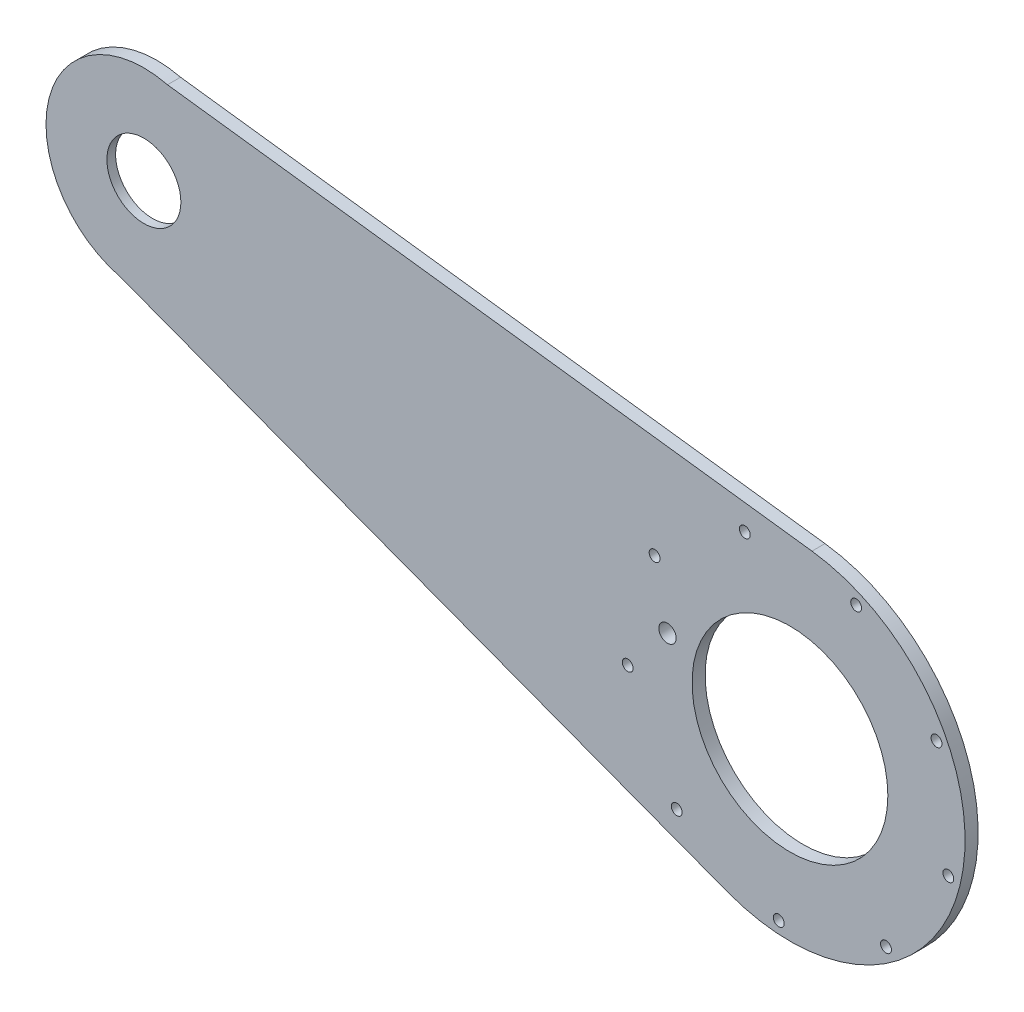
ISO-10303-21;
HEADER;
FILE_DESCRIPTION(('STEP AP214'),'2;1');
FILE_NAME('part.step','',(''),(''),'','','');
FILE_SCHEMA(('AUTOMOTIVE_DESIGN { 1 0 10303 214 1 1 1 1 }'));
ENDSEC;
DATA;
#1=APPLICATION_CONTEXT('core data for automotive mechanical design processes');
#2=APPLICATION_PROTOCOL_DEFINITION('international standard','automotive_design',2000,#1);
#3=PRODUCT_CONTEXT('',#1,'mechanical');
#4=PRODUCT('Part','Part','',(#3));
#5=PRODUCT_RELATED_PRODUCT_CATEGORY('part','',(#4));
#6=PRODUCT_DEFINITION_FORMATION('','',#4);
#7=PRODUCT_DEFINITION_CONTEXT('part definition',#1,'design');
#8=PRODUCT_DEFINITION('design','',#6,#7);
#9=PRODUCT_DEFINITION_SHAPE('','',#8);
#10=(LENGTH_UNIT() NAMED_UNIT(*) SI_UNIT(.MILLI.,.METRE.));
#11=(NAMED_UNIT(*) PLANE_ANGLE_UNIT() SI_UNIT($,.RADIAN.));
#12=(NAMED_UNIT(*) SI_UNIT($,.STERADIAN.) SOLID_ANGLE_UNIT());
#13=UNCERTAINTY_MEASURE_WITH_UNIT(LENGTH_MEASURE(1.E-05),#10,'distance_accuracy_value','');
#14=(GEOMETRIC_REPRESENTATION_CONTEXT(3) GLOBAL_UNCERTAINTY_ASSIGNED_CONTEXT((#13)) GLOBAL_UNIT_ASSIGNED_CONTEXT((#10,
#11,#12)) REPRESENTATION_CONTEXT('',''));
#15=CARTESIAN_POINT('',(0.,0.,0.));
#16=DIRECTION('',(0.,0.,1.));
#17=DIRECTION('',(1.,0.,0.));
#18=AXIS2_PLACEMENT_3D('',#15,#16,#17);
#19=CARTESIAN_POINT('',(-242.895087832448,97.1929347038201,3.));
#20=DIRECTION('',(0.,0.,-1.));
#21=DIRECTION('',(-1.,0.,0.));
#22=AXIS2_PLACEMENT_3D('',#19,#20,#21);
#23=CYLINDRICAL_SURFACE('',#22,11.5);
#24=CARTESIAN_POINT('',(-242.895087832448,97.1929347038201,0.));
#25=DIRECTION('',(0.,0.,1.));
#26=DIRECTION('',(1.,0.,0.));
#27=AXIS2_PLACEMENT_3D('',#24,#25,#26);
#28=CIRCLE('',#27,11.5);
#29=CARTESIAN_POINT('',(-231.395087832448,97.1929347038201,0.));
#30=VERTEX_POINT('',#29);
#31=EDGE_CURVE('E126',#30,#30,#28,.T.);
#32=ORIENTED_EDGE('',*,*,#31,.F.);
#33=EDGE_LOOP('',(#32));
#34=FACE_BOUND('',#33,.T.);
#35=CARTESIAN_POINT('',(-242.895087832448,97.1929347038201,1.));
#36=DIRECTION('',(0.,0.,1.));
#37=DIRECTION('',(1.,0.,0.));
#38=AXIS2_PLACEMENT_3D('',#35,#36,#37);
#39=CIRCLE('',#38,11.5);
#40=CARTESIAN_POINT('',(-231.395087832448,97.1929347038201,1.));
#41=VERTEX_POINT('',#40);
#42=EDGE_CURVE('E150',#41,#41,#39,.T.);
#43=ORIENTED_EDGE('',*,*,#42,.T.);
#44=EDGE_LOOP('',(#43));
#45=FACE_BOUND('',#44,.T.);
#46=ADVANCED_FACE('F42',(#34,#45),#23,.F.);
#47=CARTESIAN_POINT('',(-6.03186014017551,-15.997487339113,3.));
#48=DIRECTION('',(0.35280495243942,0.935696887637347,0.));
#49=DIRECTION('',(-0.935696887637348,0.35280495243942,0.));
#50=AXIS2_PLACEMENT_3D('',#47,#48,#49);
#51=PLANE('',#50);
#52=DIRECTION('',(0.935696887637348,-0.35280495243942,0.));
#53=VECTOR('',#52,1.);
#54=CARTESIAN_POINT('',(-6.03186014017551,-15.997487339113,0.));
#55=LINE('',#54,#53);
#56=CARTESIAN_POINT('',(-248.314941285306,75.3554625847872,0.));
#57=VERTEX_POINT('',#56);
#58=CARTESIAN_POINT('',(-108.60067589508,22.6761329777708,0.));
#59=VERTEX_POINT('',#58);
#60=EDGE_CURVE('E112',#57,#59,#55,.T.);
#61=ORIENTED_EDGE('',*,*,#60,.T.);
#62=DIRECTION('',(0.,0.,-1.));
#63=VECTOR('',#62,1.);
#64=CARTESIAN_POINT('',(-108.60067589508,22.6761329777708,3.));
#65=LINE('',#64,#63);
#66=CARTESIAN_POINT('',(-108.60067589508,22.6761329777708,3.));
#67=VERTEX_POINT('',#66);
#68=EDGE_CURVE('E11',#67,#59,#65,.T.);
#69=ORIENTED_EDGE('',*,*,#68,.F.);
#70=DIRECTION('',(0.935696887637348,-0.35280495243942,0.));
#71=VECTOR('',#70,1.);
#72=CARTESIAN_POINT('',(-6.03186014017551,-15.997487339113,3.));
#73=LINE('',#72,#71);
#74=CARTESIAN_POINT('',(-248.314941285306,75.3554625847872,3.));
#75=VERTEX_POINT('',#74);
#76=EDGE_CURVE('E91',#75,#67,#73,.T.);
#77=ORIENTED_EDGE('',*,*,#76,.F.);
#78=DIRECTION('',(0.,0.,-1.));
#79=VECTOR('',#78,1.);
#80=CARTESIAN_POINT('',(-248.314941285306,75.3554625847872,3.));
#81=LINE('',#80,#79);
#82=EDGE_CURVE('E111',#75,#57,#81,.T.);
#83=ORIENTED_EDGE('',*,*,#82,.T.);
#84=EDGE_LOOP('',(#61,#69,#77,#83));
#85=FACE_BOUND('',#84,.T.);
#86=ADVANCED_FACE('F44',(#85),#51,.F.);
#87=CARTESIAN_POINT('',(-94.400277143852,60.3379311550941,3.));
#88=DIRECTION('',(0.,0.,-1.));
#89=DIRECTION('',(-1.,0.,0.));
#90=AXIS2_PLACEMENT_3D('',#87,#88,#89);
#91=CYLINDRICAL_SURFACE('',#90,40.2499983433954);
#92=CARTESIAN_POINT('',(-94.400277143852,60.3379311550941,0.));
#93=DIRECTION('',(0.,0.,1.));
#94=DIRECTION('',(1.,0.,0.));
#95=AXIS2_PLACEMENT_3D('',#92,#93,#94);
#96=CIRCLE('',#95,40.2499983433954);
#97=CARTESIAN_POINT('',(-89.3428783464584,100.268935200165,0.));
#98=VERTEX_POINT('',#97);
#99=EDGE_CURVE('E96',#59,#98,#96,.T.);
#100=ORIENTED_EDGE('',*,*,#99,.T.);
#101=DIRECTION('',(0.,0.,-1.));
#102=VECTOR('',#101,1.);
#103=CARTESIAN_POINT('',(-89.3428783464584,100.268935200165,3.));
#104=LINE('',#103,#102);
#105=CARTESIAN_POINT('',(-89.3428783464584,100.268935200165,3.));
#106=VERTEX_POINT('',#105);
#107=EDGE_CURVE('E51',#106,#98,#104,.T.);
#108=ORIENTED_EDGE('',*,*,#107,.F.);
#109=CARTESIAN_POINT('',(-94.400277143852,60.3379311550941,3.));
#110=DIRECTION('',(0.,0.,1.));
#111=DIRECTION('',(1.,0.,0.));
#112=AXIS2_PLACEMENT_3D('',#109,#110,#111);
#113=CIRCLE('',#112,40.2499983433954);
#114=EDGE_CURVE('E85',#67,#106,#113,.T.);
#115=ORIENTED_EDGE('',*,*,#114,.F.);
#116=ORIENTED_EDGE('',*,*,#68,.T.);
#117=EDGE_LOOP('',(#100,#108,#115,#116));
#118=FACE_BOUND('',#117,.T.);
#119=ADVANCED_FACE('F95',(#118),#91,.T.);
#120=CARTESIAN_POINT('',(11.0883779329436,87.5489716812189,3.));
#121=DIRECTION('',(0.125649664734048,0.992074675491831,0.));
#122=DIRECTION('',(-0.992074675491831,0.125649664734048,0.));
#123=AXIS2_PLACEMENT_3D('',#120,#121,#122);
#124=PLANE('',#123);
#125=DIRECTION('',(0.992074675491831,-0.125649664734048,0.));
#126=VECTOR('',#125,1.);
#127=CARTESIAN_POINT('',(11.0883779329436,87.5489716812189,0.));
#128=LINE('',#127,#126);
#129=CARTESIAN_POINT('',(-237.475234379589,119.030406822853,0.));
#130=VERTEX_POINT('',#129);
#131=EDGE_CURVE('E117',#130,#98,#128,.T.);
#132=ORIENTED_EDGE('',*,*,#131,.F.);
#133=DIRECTION('',(0.,0.,-1.));
#134=VECTOR('',#133,1.);
#135=CARTESIAN_POINT('',(-237.475234379589,119.030406822853,3.));
#136=LINE('',#135,#134);
#137=CARTESIAN_POINT('',(-237.475234379589,119.030406822853,3.));
#138=VERTEX_POINT('',#137);
#139=EDGE_CURVE('E75',#138,#130,#136,.T.);
#140=ORIENTED_EDGE('',*,*,#139,.F.);
#141=DIRECTION('',(0.992074675491831,-0.125649664734048,0.));
#142=VECTOR('',#141,1.);
#143=CARTESIAN_POINT('',(11.0883779329436,87.5489716812189,3.));
#144=LINE('',#143,#142);
#145=EDGE_CURVE('E89',#138,#106,#144,.T.);
#146=ORIENTED_EDGE('',*,*,#145,.T.);
#147=ORIENTED_EDGE('',*,*,#107,.T.);
#148=EDGE_LOOP('',(#132,#140,#146,#147));
#149=FACE_BOUND('',#148,.T.);
#150=ADVANCED_FACE('F100',(#149),#124,.T.);
#151=CARTESIAN_POINT('',(-94.4002770300241,60.3379328077848,3.));
#152=DIRECTION('',(0.,0.,-1.));
#153=DIRECTION('',(-1.,0.,0.));
#154=AXIS2_PLACEMENT_3D('',#151,#152,#153);
#155=CYLINDRICAL_SURFACE('',#154,22.5);
#156=CARTESIAN_POINT('',(-94.4002770300241,60.3379328077848,3.));
#157=DIRECTION('',(0.,0.,1.));
#158=DIRECTION('',(1.,0.,0.));
#159=AXIS2_PLACEMENT_3D('',#156,#157,#158);
#160=CIRCLE('',#159,22.5);
#161=CARTESIAN_POINT('',(-71.9002770300241,60.3379328077848,3.));
#162=VERTEX_POINT('',#161);
#163=EDGE_CURVE('E108',#162,#162,#160,.T.);
#164=ORIENTED_EDGE('',*,*,#163,.T.);
#165=EDGE_LOOP('',(#164));
#166=FACE_BOUND('',#165,.T.);
#167=CARTESIAN_POINT('',(-94.4002770300241,60.3379328077848,0.));
#168=DIRECTION('',(0.,0.,1.));
#169=DIRECTION('',(1.,0.,0.));
#170=AXIS2_PLACEMENT_3D('',#167,#168,#169);
#171=CIRCLE('',#170,22.5);
#172=CARTESIAN_POINT('',(-71.9002770300241,60.3379328077848,0.));
#173=VERTEX_POINT('',#172);
#174=EDGE_CURVE('E123',#173,#173,#171,.T.);
#175=ORIENTED_EDGE('',*,*,#174,.F.);
#176=EDGE_LOOP('',(#175));
#177=FACE_BOUND('',#176,.T.);
#178=ADVANCED_FACE('F257',(#166,#177),#155,.F.);
#179=CARTESIAN_POINT('',(-122.546352319498,67.3235200498904,3.));
#180=DIRECTION('',(0.,0.,-1.));
#181=DIRECTION('',(-1.,0.,0.));
#182=AXIS2_PLACEMENT_3D('',#179,#180,#181);
#183=CYLINDRICAL_SURFACE('',#182,1.99999999999592);
#184=CARTESIAN_POINT('',(-122.546352319498,67.3235200498904,3.));
#185=DIRECTION('',(0.,0.,1.));
#186=DIRECTION('',(1.,0.,0.));
#187=AXIS2_PLACEMENT_3D('',#184,#185,#186);
#188=CIRCLE('',#187,1.99999999999592);
#189=CARTESIAN_POINT('',(-120.546352319502,67.3235200498904,3.));
#190=VERTEX_POINT('',#189);
#191=EDGE_CURVE('E102',#190,#190,#188,.T.);
#192=ORIENTED_EDGE('',*,*,#191,.T.);
#193=EDGE_LOOP('',(#192));
#194=FACE_BOUND('',#193,.T.);
#195=CARTESIAN_POINT('',(-122.546352319498,67.3235200498904,0.));
#196=DIRECTION('',(0.,0.,1.));
#197=DIRECTION('',(1.,0.,0.));
#198=AXIS2_PLACEMENT_3D('',#195,#196,#197);
#199=CIRCLE('',#198,1.99999999999592);
#200=CARTESIAN_POINT('',(-120.546352319502,67.3235200498904,0.));
#201=VERTEX_POINT('',#200);
#202=EDGE_CURVE('E120',#201,#201,#199,.T.);
#203=ORIENTED_EDGE('',*,*,#202,.F.);
#204=EDGE_LOOP('',(#203));
#205=FACE_BOUND('',#204,.T.);
#206=ADVANCED_FACE('F260',(#194,#205),#183,.F.);
#207=CARTESIAN_POINT('',(-242.895087832448,97.1929347038201,3.));
#208=DIRECTION('',(0.,0.,-1.));
#209=DIRECTION('',(-1.,0.,0.));
#210=AXIS2_PLACEMENT_3D('',#207,#208,#209);
#211=CYLINDRICAL_SURFACE('',#210,22.5);
#212=CARTESIAN_POINT('',(-242.895087832448,97.1929347038201,0.));
#213=DIRECTION('',(0.,0.,1.));
#214=DIRECTION('',(1.,0.,0.));
#215=AXIS2_PLACEMENT_3D('',#212,#213,#214);
#216=CIRCLE('',#215,22.5);
#217=EDGE_CURVE('E78',#130,#57,#216,.T.);
#218=ORIENTED_EDGE('',*,*,#217,.T.);
#219=ORIENTED_EDGE('',*,*,#82,.F.);
#220=CARTESIAN_POINT('',(-242.895087832448,97.1929347038201,3.));
#221=DIRECTION('',(0.,0.,1.));
#222=DIRECTION('',(1.,0.,0.));
#223=AXIS2_PLACEMENT_3D('',#220,#221,#222);
#224=CIRCLE('',#223,22.5);
#225=EDGE_CURVE('E59',#138,#75,#224,.T.);
#226=ORIENTED_EDGE('',*,*,#225,.F.);
#227=ORIENTED_EDGE('',*,*,#139,.T.);
#228=EDGE_LOOP('',(#218,#219,#226,#227));
#229=FACE_BOUND('',#228,.T.);
#230=ADVANCED_FACE('F218',(#229),#211,.T.);
#231=CARTESIAN_POINT('',(0.,0.,3.));
#232=DIRECTION('',(0.,0.,1.));
#233=DIRECTION('',(1.,0.,0.));
#234=AXIS2_PLACEMENT_3D('',#231,#232,#233);
#235=PLANE('',#234);
#236=CARTESIAN_POINT('',(-79.1835361175509,94.6118411930795,3.));
#237=DIRECTION('',(0.,0.,1.));
#238=DIRECTION('',(1.,0.,0.));
#239=AXIS2_PLACEMENT_3D('',#236,#237,#238);
#240=CIRCLE('',#239,1.25);
#241=CARTESIAN_POINT('',(-77.9335361175509,94.6118411930795,3.));
#242=VERTEX_POINT('',#241);
#243=EDGE_CURVE('E210',#242,#242,#240,.T.);
#244=ORIENTED_EDGE('',*,*,#243,.F.);
#245=EDGE_LOOP('',(#244));
#246=FACE_BOUND('',#245,.T.);
#247=CARTESIAN_POINT('',(-60.7127335660573,76.8121373519574,3.));
#248=DIRECTION('',(0.,0.,1.));
#249=DIRECTION('',(1.,0.,0.));
#250=AXIS2_PLACEMENT_3D('',#247,#248,#249);
#251=CIRCLE('',#250,1.25);
#252=CARTESIAN_POINT('',(-59.4627335660573,76.8121373519574,3.));
#253=VERTEX_POINT('',#252);
#254=EDGE_CURVE('E204',#253,#253,#251,.T.);
#255=ORIENTED_EDGE('',*,*,#254,.F.);
#256=EDGE_LOOP('',(#255));
#257=FACE_BOUND('',#256,.T.);
#258=CARTESIAN_POINT('',(-58.0047071105226,51.303968461522,3.));
#259=DIRECTION('',(0.,0.,1.));
#260=DIRECTION('',(1.,0.,0.));
#261=AXIS2_PLACEMENT_3D('',#258,#259,#260);
#262=CIRCLE('',#261,1.25);
#263=CARTESIAN_POINT('',(-56.7547071105226,51.303968461522,3.));
#264=VERTEX_POINT('',#263);
#265=EDGE_CURVE('E198',#264,#264,#262,.T.);
#266=ORIENTED_EDGE('',*,*,#265,.F.);
#267=EDGE_LOOP('',(#266));
#268=FACE_BOUND('',#267,.T.);
#269=CARTESIAN_POINT('',(-72.3265722514645,30.0228927694381,3.));
#270=DIRECTION('',(0.,0.,1.));
#271=DIRECTION('',(1.,0.,0.));
#272=AXIS2_PLACEMENT_3D('',#269,#270,#271);
#273=CIRCLE('',#272,1.25);
#274=CARTESIAN_POINT('',(-71.0765722514645,30.0228927694381,3.));
#275=VERTEX_POINT('',#274);
#276=EDGE_CURVE('E192',#275,#275,#273,.T.);
#277=ORIENTED_EDGE('',*,*,#276,.F.);
#278=EDGE_LOOP('',(#277));
#279=FACE_BOUND('',#278,.T.);
#280=CARTESIAN_POINT('',(-96.9769691196347,22.9265621048115,3.));
#281=DIRECTION('',(0.,0.,1.));
#282=DIRECTION('',(1.,0.,0.));
#283=AXIS2_PLACEMENT_3D('',#280,#281,#282);
#284=CIRCLE('',#283,1.25);
#285=CARTESIAN_POINT('',(-95.7269691196347,22.9265621048115,3.));
#286=VERTEX_POINT('',#285);
#287=EDGE_CURVE('E186',#286,#286,#284,.T.);
#288=ORIENTED_EDGE('',*,*,#287,.F.);
#289=EDGE_LOOP('',(#288));
#290=FACE_BOUND('',#289,.T.);
#291=CARTESIAN_POINT('',(-120.421703236162,33.3354259204866,3.));
#292=DIRECTION('',(0.,0.,1.));
#293=DIRECTION('',(1.,0.,0.));
#294=AXIS2_PLACEMENT_3D('',#291,#292,#293);
#295=CIRCLE('',#294,1.25);
#296=CARTESIAN_POINT('',(-119.171703236162,33.3354259204866,3.));
#297=VERTEX_POINT('',#296);
#298=EDGE_CURVE('E180',#297,#297,#295,.T.);
#299=ORIENTED_EDGE('',*,*,#298,.F.);
#300=EDGE_LOOP('',(#299));
#301=FACE_BOUND('',#300,.T.);
#302=CARTESIAN_POINT('',(-131.690722834899,56.3790628081667,3.));
#303=DIRECTION('',(0.,0.,1.));
#304=DIRECTION('',(1.,0.,0.));
#305=AXIS2_PLACEMENT_3D('',#302,#303,#304);
#306=CIRCLE('',#305,1.25);
#307=CARTESIAN_POINT('',(-130.440722834899,56.3790628081667,3.));
#308=VERTEX_POINT('',#307);
#309=EDGE_CURVE('E174',#308,#308,#306,.T.);
#310=ORIENTED_EDGE('',*,*,#309,.F.);
#311=EDGE_LOOP('',(#310));
#312=FACE_BOUND('',#311,.T.);
#313=CARTESIAN_POINT('',(-125.511128404411,81.2750989666098,3.));
#314=DIRECTION('',(0.,0.,1.));
#315=DIRECTION('',(1.,0.,0.));
#316=AXIS2_PLACEMENT_3D('',#313,#314,#315);
#317=CIRCLE('',#316,1.25);
#318=CARTESIAN_POINT('',(-124.261128404411,81.2750989666098,3.));
#319=VERTEX_POINT('',#318);
#320=EDGE_CURVE('E168',#319,#319,#317,.T.);
#321=ORIENTED_EDGE('',*,*,#320,.F.);
#322=EDGE_LOOP('',(#321));
#323=FACE_BOUND('',#322,.T.);
#324=CARTESIAN_POINT('',(-104.774420857237,96.3744023886648,3.));
#325=DIRECTION('',(0.,0.,1.));
#326=DIRECTION('',(1.,0.,0.));
#327=AXIS2_PLACEMENT_3D('',#324,#325,#326);
#328=CIRCLE('',#327,1.25);
#329=CARTESIAN_POINT('',(-103.524420857237,96.3744023886648,3.));
#330=VERTEX_POINT('',#329);
#331=EDGE_CURVE('E162',#330,#330,#328,.T.);
#332=ORIENTED_EDGE('',*,*,#331,.F.);
#333=EDGE_LOOP('',(#332));
#334=FACE_BOUND('',#333,.T.);
#335=ORIENTED_EDGE('',*,*,#76,.T.);
#336=ORIENTED_EDGE('',*,*,#114,.T.);
#337=ORIENTED_EDGE('',*,*,#145,.F.);
#338=ORIENTED_EDGE('',*,*,#225,.T.);
#339=EDGE_LOOP('',(#335,#336,#337,#338));
#340=FACE_BOUND('',#339,.T.);
#341=ORIENTED_EDGE('',*,*,#191,.F.);
#342=EDGE_LOOP('',(#341));
#343=FACE_BOUND('',#342,.T.);
#344=ORIENTED_EDGE('',*,*,#163,.F.);
#345=EDGE_LOOP('',(#344));
#346=FACE_BOUND('',#345,.T.);
#347=CARTESIAN_POINT('',(-242.895087832448,97.1929347038201,3.));
#348=DIRECTION('',(0.,0.,1.));
#349=DIRECTION('',(1.,0.,0.));
#350=AXIS2_PLACEMENT_3D('',#347,#348,#349);
#351=CIRCLE('',#350,8.50000000000001);
#352=CARTESIAN_POINT('',(-234.395087832448,97.1929347038201,3.));
#353=VERTEX_POINT('',#352);
#354=EDGE_CURVE('E115',#353,#353,#351,.T.);
#355=ORIENTED_EDGE('',*,*,#354,.F.);
#356=EDGE_LOOP('',(#355));
#357=FACE_BOUND('',#356,.T.);
#358=ADVANCED_FACE('F86',(#246,#257,#268,#279,#290,#301,#312,#323,#334,#340,#343,#346,#357),
#235,.T.);
#359=CARTESIAN_POINT('',(0.,0.,0.));
#360=DIRECTION('',(0.,0.,1.));
#361=DIRECTION('',(1.,0.,0.));
#362=AXIS2_PLACEMENT_3D('',#359,#360,#361);
#363=PLANE('',#362);
#364=CARTESIAN_POINT('',(-79.1835361175509,94.6118411930795,0.));
#365=DIRECTION('',(0.,0.,1.));
#366=DIRECTION('',(1.,0.,0.));
#367=AXIS2_PLACEMENT_3D('',#364,#365,#366);
#368=CIRCLE('',#367,1.25);
#369=CARTESIAN_POINT('',(-77.9335361175509,94.6118411930795,0.));
#370=VERTEX_POINT('',#369);
#371=EDGE_CURVE('E207',#370,#370,#368,.T.);
#372=ORIENTED_EDGE('',*,*,#371,.T.);
#373=EDGE_LOOP('',(#372));
#374=FACE_BOUND('',#373,.T.);
#375=CARTESIAN_POINT('',(-60.7127335660573,76.8121373519574,0.));
#376=DIRECTION('',(0.,0.,1.));
#377=DIRECTION('',(1.,0.,0.));
#378=AXIS2_PLACEMENT_3D('',#375,#376,#377);
#379=CIRCLE('',#378,1.25);
#380=CARTESIAN_POINT('',(-59.4627335660573,76.8121373519574,0.));
#381=VERTEX_POINT('',#380);
#382=EDGE_CURVE('E201',#381,#381,#379,.T.);
#383=ORIENTED_EDGE('',*,*,#382,.T.);
#384=EDGE_LOOP('',(#383));
#385=FACE_BOUND('',#384,.T.);
#386=CARTESIAN_POINT('',(-58.0047071105226,51.303968461522,0.));
#387=DIRECTION('',(0.,0.,1.));
#388=DIRECTION('',(1.,0.,0.));
#389=AXIS2_PLACEMENT_3D('',#386,#387,#388);
#390=CIRCLE('',#389,1.25);
#391=CARTESIAN_POINT('',(-56.7547071105226,51.303968461522,0.));
#392=VERTEX_POINT('',#391);
#393=EDGE_CURVE('E195',#392,#392,#390,.T.);
#394=ORIENTED_EDGE('',*,*,#393,.T.);
#395=EDGE_LOOP('',(#394));
#396=FACE_BOUND('',#395,.T.);
#397=CARTESIAN_POINT('',(-72.3265722514645,30.0228927694381,0.));
#398=DIRECTION('',(0.,0.,1.));
#399=DIRECTION('',(1.,0.,0.));
#400=AXIS2_PLACEMENT_3D('',#397,#398,#399);
#401=CIRCLE('',#400,1.25);
#402=CARTESIAN_POINT('',(-71.0765722514645,30.0228927694381,0.));
#403=VERTEX_POINT('',#402);
#404=EDGE_CURVE('E189',#403,#403,#401,.T.);
#405=ORIENTED_EDGE('',*,*,#404,.T.);
#406=EDGE_LOOP('',(#405));
#407=FACE_BOUND('',#406,.T.);
#408=CARTESIAN_POINT('',(-96.9769691196347,22.9265621048115,0.));
#409=DIRECTION('',(0.,0.,1.));
#410=DIRECTION('',(1.,0.,0.));
#411=AXIS2_PLACEMENT_3D('',#408,#409,#410);
#412=CIRCLE('',#411,1.25);
#413=CARTESIAN_POINT('',(-95.7269691196347,22.9265621048115,0.));
#414=VERTEX_POINT('',#413);
#415=EDGE_CURVE('E183',#414,#414,#412,.T.);
#416=ORIENTED_EDGE('',*,*,#415,.T.);
#417=EDGE_LOOP('',(#416));
#418=FACE_BOUND('',#417,.T.);
#419=CARTESIAN_POINT('',(-120.421703236162,33.3354259204866,0.));
#420=DIRECTION('',(0.,0.,1.));
#421=DIRECTION('',(1.,0.,0.));
#422=AXIS2_PLACEMENT_3D('',#419,#420,#421);
#423=CIRCLE('',#422,1.25);
#424=CARTESIAN_POINT('',(-119.171703236162,33.3354259204866,0.));
#425=VERTEX_POINT('',#424);
#426=EDGE_CURVE('E177',#425,#425,#423,.T.);
#427=ORIENTED_EDGE('',*,*,#426,.T.);
#428=EDGE_LOOP('',(#427));
#429=FACE_BOUND('',#428,.T.);
#430=CARTESIAN_POINT('',(-131.690722834899,56.3790628081667,0.));
#431=DIRECTION('',(0.,0.,1.));
#432=DIRECTION('',(1.,0.,0.));
#433=AXIS2_PLACEMENT_3D('',#430,#431,#432);
#434=CIRCLE('',#433,1.25);
#435=CARTESIAN_POINT('',(-130.440722834899,56.3790628081667,0.));
#436=VERTEX_POINT('',#435);
#437=EDGE_CURVE('E171',#436,#436,#434,.T.);
#438=ORIENTED_EDGE('',*,*,#437,.T.);
#439=EDGE_LOOP('',(#438));
#440=FACE_BOUND('',#439,.T.);
#441=CARTESIAN_POINT('',(-125.511128404411,81.2750989666098,0.));
#442=DIRECTION('',(0.,0.,1.));
#443=DIRECTION('',(1.,0.,0.));
#444=AXIS2_PLACEMENT_3D('',#441,#442,#443);
#445=CIRCLE('',#444,1.25);
#446=CARTESIAN_POINT('',(-124.261128404411,81.2750989666098,0.));
#447=VERTEX_POINT('',#446);
#448=EDGE_CURVE('E165',#447,#447,#445,.T.);
#449=ORIENTED_EDGE('',*,*,#448,.T.);
#450=EDGE_LOOP('',(#449));
#451=FACE_BOUND('',#450,.T.);
#452=CARTESIAN_POINT('',(-104.774420857237,96.3744023886648,0.));
#453=DIRECTION('',(0.,0.,1.));
#454=DIRECTION('',(1.,0.,0.));
#455=AXIS2_PLACEMENT_3D('',#452,#453,#454);
#456=CIRCLE('',#455,1.25);
#457=CARTESIAN_POINT('',(-103.524420857237,96.3744023886648,0.));
#458=VERTEX_POINT('',#457);
#459=EDGE_CURVE('E157',#458,#458,#456,.T.);
#460=ORIENTED_EDGE('',*,*,#459,.T.);
#461=EDGE_LOOP('',(#460));
#462=FACE_BOUND('',#461,.T.);
#463=ORIENTED_EDGE('',*,*,#60,.F.);
#464=ORIENTED_EDGE('',*,*,#217,.F.);
#465=ORIENTED_EDGE('',*,*,#131,.T.);
#466=ORIENTED_EDGE('',*,*,#99,.F.);
#467=EDGE_LOOP('',(#463,#464,#465,#466));
#468=FACE_BOUND('',#467,.T.);
#469=ORIENTED_EDGE('',*,*,#202,.T.);
#470=EDGE_LOOP('',(#469));
#471=FACE_BOUND('',#470,.T.);
#472=ORIENTED_EDGE('',*,*,#174,.T.);
#473=EDGE_LOOP('',(#472));
#474=FACE_BOUND('',#473,.T.);
#475=ORIENTED_EDGE('',*,*,#31,.T.);
#476=EDGE_LOOP('',(#475));
#477=FACE_BOUND('',#476,.T.);
#478=ADVANCED_FACE('F133',(#374,#385,#396,#407,#418,#429,#440,#451,#462,#468,#471,#474,#477),
#363,.F.);
#479=CARTESIAN_POINT('',(-242.895087832448,97.1929347038201,3.));
#480=DIRECTION('',(0.,0.,-1.));
#481=DIRECTION('',(-1.,0.,0.));
#482=AXIS2_PLACEMENT_3D('',#479,#480,#481);
#483=CYLINDRICAL_SURFACE('',#482,8.50000000000001);
#484=ORIENTED_EDGE('',*,*,#354,.T.);
#485=EDGE_LOOP('',(#484));
#486=FACE_BOUND('',#485,.T.);
#487=CARTESIAN_POINT('',(-242.895087832448,97.1929347038201,1.));
#488=DIRECTION('',(0.,0.,1.));
#489=DIRECTION('',(1.,0.,0.));
#490=AXIS2_PLACEMENT_3D('',#487,#488,#489);
#491=CIRCLE('',#490,8.50000000000001);
#492=CARTESIAN_POINT('',(-234.395087832448,97.1929347038201,1.));
#493=VERTEX_POINT('',#492);
#494=EDGE_CURVE('E152',#493,#493,#491,.T.);
#495=ORIENTED_EDGE('',*,*,#494,.F.);
#496=EDGE_LOOP('',(#495));
#497=FACE_BOUND('',#496,.T.);
#498=ADVANCED_FACE('F136',(#486,#497),#483,.F.);
#499=CARTESIAN_POINT('',(0.,0.,1.));
#500=DIRECTION('',(0.,0.,1.));
#501=DIRECTION('',(1.,0.,0.));
#502=AXIS2_PLACEMENT_3D('',#499,#500,#501);
#503=PLANE('',#502);
#504=ORIENTED_EDGE('',*,*,#494,.T.);
#505=EDGE_LOOP('',(#504));
#506=FACE_BOUND('',#505,.T.);
#507=ORIENTED_EDGE('',*,*,#42,.F.);
#508=EDGE_LOOP('',(#507));
#509=FACE_BOUND('',#508,.T.);
#510=ADVANCED_FACE('F239',(#506,#509),#503,.F.);
#511=CARTESIAN_POINT('',(-104.774420857237,96.3744023886648,3.));
#512=DIRECTION('',(0.,0.,1.));
#513=DIRECTION('',(1.,0.,0.));
#514=AXIS2_PLACEMENT_3D('',#511,#512,#513);
#515=CYLINDRICAL_SURFACE('',#514,1.25);
#516=ORIENTED_EDGE('',*,*,#459,.F.);
#517=EDGE_LOOP('',(#516));
#518=FACE_BOUND('',#517,.T.);
#519=ORIENTED_EDGE('',*,*,#331,.T.);
#520=EDGE_LOOP('',(#519));
#521=FACE_BOUND('',#520,.T.);
#522=ADVANCED_FACE('F236',(#518,#521),#515,.F.);
#523=CARTESIAN_POINT('',(-125.511128404411,81.2750989666098,3.));
#524=DIRECTION('',(0.,0.,1.));
#525=DIRECTION('',(1.,0.,0.));
#526=AXIS2_PLACEMENT_3D('',#523,#524,#525);
#527=CYLINDRICAL_SURFACE('',#526,1.25);
#528=ORIENTED_EDGE('',*,*,#448,.F.);
#529=EDGE_LOOP('',(#528));
#530=FACE_BOUND('',#529,.T.);
#531=ORIENTED_EDGE('',*,*,#320,.T.);
#532=EDGE_LOOP('',(#531));
#533=FACE_BOUND('',#532,.T.);
#534=ADVANCED_FACE('F238',(#530,#533),#527,.F.);
#535=CARTESIAN_POINT('',(-131.690722834899,56.3790628081667,3.));
#536=DIRECTION('',(0.,0.,1.));
#537=DIRECTION('',(1.,0.,0.));
#538=AXIS2_PLACEMENT_3D('',#535,#536,#537);
#539=CYLINDRICAL_SURFACE('',#538,1.25);
#540=ORIENTED_EDGE('',*,*,#437,.F.);
#541=EDGE_LOOP('',(#540));
#542=FACE_BOUND('',#541,.T.);
#543=ORIENTED_EDGE('',*,*,#309,.T.);
#544=EDGE_LOOP('',(#543));
#545=FACE_BOUND('',#544,.T.);
#546=ADVANCED_FACE('F246',(#542,#545),#539,.F.);
#547=CARTESIAN_POINT('',(-120.421703236162,33.3354259204866,3.));
#548=DIRECTION('',(0.,0.,1.));
#549=DIRECTION('',(1.,0.,0.));
#550=AXIS2_PLACEMENT_3D('',#547,#548,#549);
#551=CYLINDRICAL_SURFACE('',#550,1.25);
#552=ORIENTED_EDGE('',*,*,#426,.F.);
#553=EDGE_LOOP('',(#552));
#554=FACE_BOUND('',#553,.T.);
#555=ORIENTED_EDGE('',*,*,#298,.T.);
#556=EDGE_LOOP('',(#555));
#557=FACE_BOUND('',#556,.T.);
#558=ADVANCED_FACE('F336',(#554,#557),#551,.F.);
#559=CARTESIAN_POINT('',(-96.9769691196347,22.9265621048115,3.));
#560=DIRECTION('',(0.,0.,1.));
#561=DIRECTION('',(1.,0.,0.));
#562=AXIS2_PLACEMENT_3D('',#559,#560,#561);
#563=CYLINDRICAL_SURFACE('',#562,1.25);
#564=ORIENTED_EDGE('',*,*,#415,.F.);
#565=EDGE_LOOP('',(#564));
#566=FACE_BOUND('',#565,.T.);
#567=ORIENTED_EDGE('',*,*,#287,.T.);
#568=EDGE_LOOP('',(#567));
#569=FACE_BOUND('',#568,.T.);
#570=ADVANCED_FACE('F347',(#566,#569),#563,.F.);
#571=CARTESIAN_POINT('',(-72.3265722514645,30.0228927694381,3.));
#572=DIRECTION('',(0.,0.,1.));
#573=DIRECTION('',(1.,0.,0.));
#574=AXIS2_PLACEMENT_3D('',#571,#572,#573);
#575=CYLINDRICAL_SURFACE('',#574,1.25);
#576=ORIENTED_EDGE('',*,*,#404,.F.);
#577=EDGE_LOOP('',(#576));
#578=FACE_BOUND('',#577,.T.);
#579=ORIENTED_EDGE('',*,*,#276,.T.);
#580=EDGE_LOOP('',(#579));
#581=FACE_BOUND('',#580,.T.);
#582=ADVANCED_FACE('F359',(#578,#581),#575,.F.);
#583=CARTESIAN_POINT('',(-58.0047071105226,51.303968461522,3.));
#584=DIRECTION('',(0.,0.,1.));
#585=DIRECTION('',(1.,0.,0.));
#586=AXIS2_PLACEMENT_3D('',#583,#584,#585);
#587=CYLINDRICAL_SURFACE('',#586,1.25);
#588=ORIENTED_EDGE('',*,*,#393,.F.);
#589=EDGE_LOOP('',(#588));
#590=FACE_BOUND('',#589,.T.);
#591=ORIENTED_EDGE('',*,*,#265,.T.);
#592=EDGE_LOOP('',(#591));
#593=FACE_BOUND('',#592,.T.);
#594=ADVANCED_FACE('F371',(#590,#593),#587,.F.);
#595=CARTESIAN_POINT('',(-60.7127335660573,76.8121373519574,3.));
#596=DIRECTION('',(0.,0.,1.));
#597=DIRECTION('',(1.,0.,0.));
#598=AXIS2_PLACEMENT_3D('',#595,#596,#597);
#599=CYLINDRICAL_SURFACE('',#598,1.25);
#600=ORIENTED_EDGE('',*,*,#382,.F.);
#601=EDGE_LOOP('',(#600));
#602=FACE_BOUND('',#601,.T.);
#603=ORIENTED_EDGE('',*,*,#254,.T.);
#604=EDGE_LOOP('',(#603));
#605=FACE_BOUND('',#604,.T.);
#606=ADVANCED_FACE('F383',(#602,#605),#599,.F.);
#607=CARTESIAN_POINT('',(-79.1835361175509,94.6118411930795,3.));
#608=DIRECTION('',(0.,0.,1.));
#609=DIRECTION('',(1.,0.,0.));
#610=AXIS2_PLACEMENT_3D('',#607,#608,#609);
#611=CYLINDRICAL_SURFACE('',#610,1.25);
#612=ORIENTED_EDGE('',*,*,#371,.F.);
#613=EDGE_LOOP('',(#612));
#614=FACE_BOUND('',#613,.T.);
#615=ORIENTED_EDGE('',*,*,#243,.T.);
#616=EDGE_LOOP('',(#615));
#617=FACE_BOUND('',#616,.T.);
#618=ADVANCED_FACE('F214',(#614,#617),#611,.F.);
#619=CLOSED_SHELL('',(#46,#86,#119,#150,#178,#206,#230,#358,#478,#498,#510,#522,#534,#546,#558,
#570,#582,#594,#606,#618));
#620=MANIFOLD_SOLID_BREP('B2',#619);
#621=ADVANCED_BREP_SHAPE_REPRESENTATION('',(#18,#620),#14);
#622=SHAPE_DEFINITION_REPRESENTATION(#9,#621);
ENDSEC;
END-ISO-10303-21;
